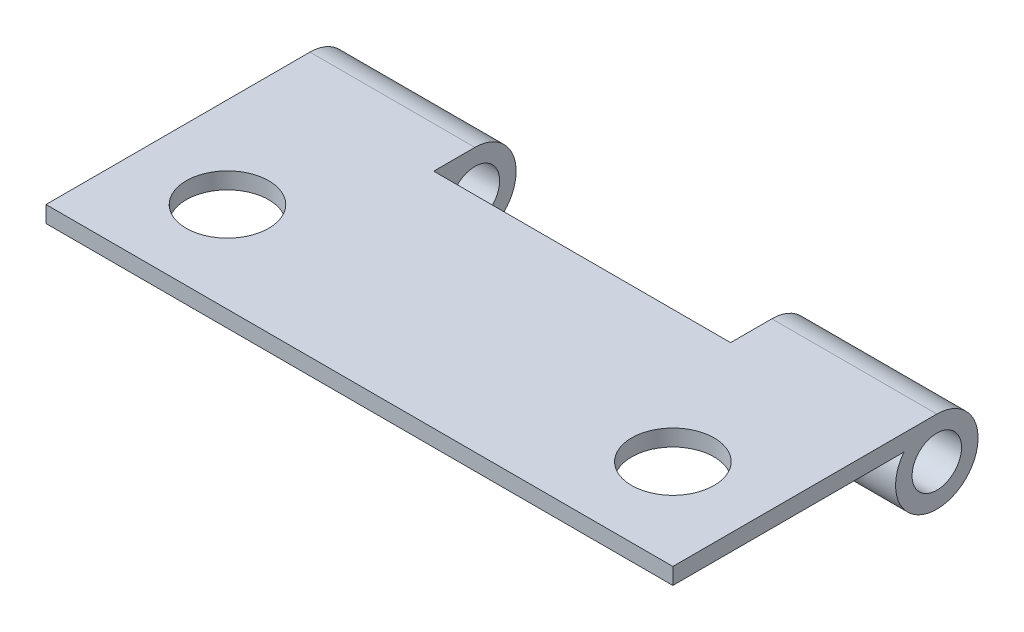
ISO-10303-21;
HEADER;
FILE_DESCRIPTION(('STEP AP214'),'2;1');
FILE_NAME('part.step','',(''),(''),'','','');
FILE_SCHEMA(('AUTOMOTIVE_DESIGN { 1 0 10303 214 1 1 1 1 }'));
ENDSEC;
DATA;
#1=APPLICATION_CONTEXT('core data for automotive mechanical design processes');
#2=APPLICATION_PROTOCOL_DEFINITION('international standard','automotive_design',2000,#1);
#3=PRODUCT_CONTEXT('',#1,'mechanical');
#4=PRODUCT('Part','Part','',(#3));
#5=PRODUCT_RELATED_PRODUCT_CATEGORY('part','',(#4));
#6=PRODUCT_DEFINITION_FORMATION('','',#4);
#7=PRODUCT_DEFINITION_CONTEXT('part definition',#1,'design');
#8=PRODUCT_DEFINITION('design','',#6,#7);
#9=PRODUCT_DEFINITION_SHAPE('','',#8);
#10=(LENGTH_UNIT() NAMED_UNIT(*) SI_UNIT(.MILLI.,.METRE.));
#11=(NAMED_UNIT(*) PLANE_ANGLE_UNIT() SI_UNIT($,.RADIAN.));
#12=(NAMED_UNIT(*) SI_UNIT($,.STERADIAN.) SOLID_ANGLE_UNIT());
#13=UNCERTAINTY_MEASURE_WITH_UNIT(LENGTH_MEASURE(1.E-05),#10,'distance_accuracy_value','');
#14=(GEOMETRIC_REPRESENTATION_CONTEXT(3) GLOBAL_UNCERTAINTY_ASSIGNED_CONTEXT((#13)) GLOBAL_UNIT_ASSIGNED_CONTEXT((#10,
#11,#12)) REPRESENTATION_CONTEXT('',''));
#15=CARTESIAN_POINT('',(0.,0.,0.));
#16=DIRECTION('',(0.,0.,1.));
#17=DIRECTION('',(1.,0.,0.));
#18=AXIS2_PLACEMENT_3D('',#15,#16,#17);
#19=CARTESIAN_POINT('',(38.,-1.50000000000001,-16.));
#20=DIRECTION('',(-1.,0.,0.));
#21=DIRECTION('',(0.,0.,1.));
#22=AXIS2_PLACEMENT_3D('',#19,#20,#21);
#23=CYLINDRICAL_SURFACE('',#22,2.50000000000001);
#24=DIRECTION('',(-1.,0.,0.));
#25=VECTOR('',#24,1.);
#26=CARTESIAN_POINT('',(38.,0.,-14.));
#27=LINE('',#26,#25);
#28=CARTESIAN_POINT('',(38.,0.,-14.));
#29=VERTEX_POINT('',#28);
#30=CARTESIAN_POINT('',(28.,0.,-14.));
#31=VERTEX_POINT('',#30);
#32=EDGE_CURVE('E43',#29,#31,#27,.T.);
#33=ORIENTED_EDGE('',*,*,#32,.T.);
#34=CARTESIAN_POINT('',(28.,-1.50000000000001,-16.));
#35=DIRECTION('',(1.,0.,0.));
#36=DIRECTION('',(0.,0.,-1.));
#37=AXIS2_PLACEMENT_3D('',#34,#35,#36);
#38=CIRCLE('',#37,2.50000000000001);
#39=CARTESIAN_POINT('',(28.,0.999999999999999,-16.));
#40=VERTEX_POINT('',#39);
#41=EDGE_CURVE('E134',#31,#40,#38,.T.);
#42=ORIENTED_EDGE('',*,*,#41,.T.);
#43=DIRECTION('',(-1.,0.,0.));
#44=VECTOR('',#43,1.);
#45=CARTESIAN_POINT('',(38.,0.999999999999998,-16.));
#46=LINE('',#45,#44);
#47=CARTESIAN_POINT('',(38.,0.999999999999998,-16.));
#48=VERTEX_POINT('',#47);
#49=EDGE_CURVE('E129',#48,#40,#46,.T.);
#50=ORIENTED_EDGE('',*,*,#49,.F.);
#51=CARTESIAN_POINT('',(38.,-1.50000000000001,-16.));
#52=DIRECTION('',(1.,0.,0.));
#53=DIRECTION('',(0.,0.,1.));
#54=AXIS2_PLACEMENT_3D('',#51,#52,#53);
#55=CIRCLE('',#54,2.50000000000001);
#56=EDGE_CURVE('E155',#29,#48,#55,.T.);
#57=ORIENTED_EDGE('',*,*,#56,.F.);
#58=EDGE_LOOP('',(#33,#42,#50,#57));
#59=FACE_BOUND('',#58,.T.);
#60=ADVANCED_FACE('F34',(#59),#23,.T.);
#61=CARTESIAN_POINT('',(38.,-1.5,-16.));
#62=DIRECTION('',(-1.,0.,0.));
#63=DIRECTION('',(0.,0.,1.));
#64=AXIS2_PLACEMENT_3D('',#61,#62,#63);
#65=CYLINDRICAL_SURFACE('',#64,1.5);
#66=CARTESIAN_POINT('',(10.,-1.5,-16.));
#67=DIRECTION('',(-1.,0.,0.));
#68=DIRECTION('',(0.,0.,1.));
#69=AXIS2_PLACEMENT_3D('',#66,#67,#68);
#70=CIRCLE('',#69,1.5);
#71=CARTESIAN_POINT('',(10.,-1.5,-14.5));
#72=VERTEX_POINT('',#71);
#73=EDGE_CURVE('E38',#72,#72,#70,.T.);
#74=ORIENTED_EDGE('',*,*,#73,.F.);
#75=EDGE_LOOP('',(#74));
#76=FACE_BOUND('',#75,.T.);
#77=CARTESIAN_POINT('',(0.,-1.5,-16.));
#78=DIRECTION('',(1.,0.,0.));
#79=DIRECTION('',(0.,0.,-1.));
#80=AXIS2_PLACEMENT_3D('',#77,#78,#79);
#81=CIRCLE('',#80,1.5);
#82=CARTESIAN_POINT('',(0.,-1.5,-17.5));
#83=VERTEX_POINT('',#82);
#84=EDGE_CURVE('E145',#83,#83,#81,.T.);
#85=ORIENTED_EDGE('',*,*,#84,.F.);
#86=EDGE_LOOP('',(#85));
#87=FACE_BOUND('',#86,.T.);
#88=ADVANCED_FACE('F181',(#76,#87),#65,.F.);
#89=CARTESIAN_POINT('',(38.,-1.50000000000001,-16.));
#90=DIRECTION('',(-1.,0.,0.));
#91=DIRECTION('',(0.,0.,1.));
#92=AXIS2_PLACEMENT_3D('',#89,#90,#91);
#93=PLANE('',#92);
#94=DIRECTION('',(0.,-1.,0.));
#95=VECTOR('',#94,1.);
#96=CARTESIAN_POINT('',(38.,0.,0.));
#97=LINE('',#96,#95);
#98=CARTESIAN_POINT('',(38.,1.,0.));
#99=VERTEX_POINT('',#98);
#100=CARTESIAN_POINT('',(38.,0.,0.));
#101=VERTEX_POINT('',#100);
#102=EDGE_CURVE('E152',#99,#101,#97,.T.);
#103=ORIENTED_EDGE('',*,*,#102,.T.);
#104=DIRECTION('',(0.,0.,-1.));
#105=VECTOR('',#104,1.);
#106=CARTESIAN_POINT('',(38.,0.,0.));
#107=LINE('',#106,#105);
#108=EDGE_CURVE('E87',#101,#29,#107,.T.);
#109=ORIENTED_EDGE('',*,*,#108,.T.);
#110=ORIENTED_EDGE('',*,*,#56,.T.);
#111=DIRECTION('',(0.,0.,1.));
#112=VECTOR('',#111,1.);
#113=CARTESIAN_POINT('',(38.,0.999999999999999,-16.));
#114=LINE('',#113,#112);
#115=EDGE_CURVE('E60',#48,#99,#114,.T.);
#116=ORIENTED_EDGE('',*,*,#115,.T.);
#117=EDGE_LOOP('',(#103,#109,#110,#116));
#118=FACE_BOUND('',#117,.T.);
#119=CARTESIAN_POINT('',(38.,-1.5,-16.));
#120=DIRECTION('',(1.,0.,0.));
#121=DIRECTION('',(0.,0.,-1.));
#122=AXIS2_PLACEMENT_3D('',#119,#120,#121);
#123=CIRCLE('',#122,1.5);
#124=CARTESIAN_POINT('',(38.,-1.5,-17.5));
#125=VERTEX_POINT('',#124);
#126=EDGE_CURVE('E146',#125,#125,#123,.T.);
#127=ORIENTED_EDGE('',*,*,#126,.F.);
#128=EDGE_LOOP('',(#127));
#129=FACE_BOUND('',#128,.T.);
#130=ADVANCED_FACE('F184',(#118,#129),#93,.F.);
#131=CARTESIAN_POINT('',(0.,-1.50000000000001,-16.));
#132=DIRECTION('',(-1.,0.,0.));
#133=DIRECTION('',(0.,0.,1.));
#134=AXIS2_PLACEMENT_3D('',#131,#132,#133);
#135=PLANE('',#134);
#136=DIRECTION('',(0.,-1.,0.));
#137=VECTOR('',#136,1.);
#138=CARTESIAN_POINT('',(0.,0.,0.));
#139=LINE('',#138,#137);
#140=CARTESIAN_POINT('',(0.,1.,0.));
#141=VERTEX_POINT('',#140);
#142=CARTESIAN_POINT('',(0.,0.,0.));
#143=VERTEX_POINT('',#142);
#144=EDGE_CURVE('E149',#141,#143,#139,.T.);
#145=ORIENTED_EDGE('',*,*,#144,.F.);
#146=DIRECTION('',(0.,0.,1.));
#147=VECTOR('',#146,1.);
#148=CARTESIAN_POINT('',(0.,0.999999999999999,-16.));
#149=LINE('',#148,#147);
#150=CARTESIAN_POINT('',(0.,0.999999999999998,-16.));
#151=VERTEX_POINT('',#150);
#152=EDGE_CURVE('E80',#151,#141,#149,.T.);
#153=ORIENTED_EDGE('',*,*,#152,.F.);
#154=CARTESIAN_POINT('',(0.,-1.50000000000001,-16.));
#155=DIRECTION('',(1.,0.,0.));
#156=DIRECTION('',(0.,0.,1.));
#157=AXIS2_PLACEMENT_3D('',#154,#155,#156);
#158=CIRCLE('',#157,2.50000000000001);
#159=CARTESIAN_POINT('',(0.,0.,-14.));
#160=VERTEX_POINT('',#159);
#161=EDGE_CURVE('E164',#160,#151,#158,.T.);
#162=ORIENTED_EDGE('',*,*,#161,.F.);
#163=DIRECTION('',(0.,0.,-1.));
#164=VECTOR('',#163,1.);
#165=CARTESIAN_POINT('',(0.,0.,0.));
#166=LINE('',#165,#164);
#167=EDGE_CURVE('E161',#143,#160,#166,.T.);
#168=ORIENTED_EDGE('',*,*,#167,.F.);
#169=EDGE_LOOP('',(#145,#153,#162,#168));
#170=FACE_BOUND('',#169,.T.);
#171=ORIENTED_EDGE('',*,*,#84,.T.);
#172=EDGE_LOOP('',(#171));
#173=FACE_BOUND('',#172,.T.);
#174=ADVANCED_FACE('F186',(#170,#173),#135,.T.);
#175=CARTESIAN_POINT('',(38.,0.,0.));
#176=DIRECTION('',(0.,0.,-1.));
#177=DIRECTION('',(-1.,0.,0.));
#178=AXIS2_PLACEMENT_3D('',#175,#176,#177);
#179=PLANE('',#178);
#180=ORIENTED_EDGE('',*,*,#144,.T.);
#181=DIRECTION('',(-1.,0.,0.));
#182=VECTOR('',#181,1.);
#183=CARTESIAN_POINT('',(38.,0.,0.));
#184=LINE('',#183,#182);
#185=EDGE_CURVE('E11',#101,#143,#184,.T.);
#186=ORIENTED_EDGE('',*,*,#185,.F.);
#187=ORIENTED_EDGE('',*,*,#102,.F.);
#188=DIRECTION('',(-1.,0.,0.));
#189=VECTOR('',#188,1.);
#190=CARTESIAN_POINT('',(38.,1.,0.));
#191=LINE('',#190,#189);
#192=EDGE_CURVE('E158',#99,#141,#191,.T.);
#193=ORIENTED_EDGE('',*,*,#192,.T.);
#194=EDGE_LOOP('',(#180,#186,#187,#193));
#195=FACE_BOUND('',#194,.T.);
#196=ADVANCED_FACE('F36',(#195),#179,.F.);
#197=CARTESIAN_POINT('',(38.,0.,0.));
#198=DIRECTION('',(0.,1.,0.));
#199=DIRECTION('',(0.,0.,1.));
#200=AXIS2_PLACEMENT_3D('',#197,#198,#199);
#201=PLANE('',#200);
#202=CARTESIAN_POINT('',(32.5,0.,-5.5));
#203=DIRECTION('',(0.,1.,0.));
#204=DIRECTION('',(0.,0.,1.));
#205=AXIS2_PLACEMENT_3D('',#202,#203,#204);
#206=CIRCLE('',#205,2.5);
#207=CARTESIAN_POINT('',(32.5,0.,-3.));
#208=VERTEX_POINT('',#207);
#209=EDGE_CURVE('E222',#208,#208,#206,.T.);
#210=ORIENTED_EDGE('',*,*,#209,.T.);
#211=EDGE_LOOP('',(#210));
#212=FACE_BOUND('',#211,.T.);
#213=CARTESIAN_POINT('',(5.5,0.,-5.5));
#214=DIRECTION('',(0.,1.,0.));
#215=DIRECTION('',(0.,0.,1.));
#216=AXIS2_PLACEMENT_3D('',#213,#214,#215);
#217=CIRCLE('',#216,2.5);
#218=CARTESIAN_POINT('',(5.5,0.,-3.));
#219=VERTEX_POINT('',#218);
#220=EDGE_CURVE('E215',#219,#219,#217,.T.);
#221=ORIENTED_EDGE('',*,*,#220,.T.);
#222=EDGE_LOOP('',(#221));
#223=FACE_BOUND('',#222,.T.);
#224=CARTESIAN_POINT('',(10.,0.,-14.));
#225=VERTEX_POINT('',#224);
#226=EDGE_CURVE('E171',#225,#160,#27,.T.);
#227=ORIENTED_EDGE('',*,*,#226,.F.);
#228=DIRECTION('',(0.,0.,1.));
#229=VECTOR('',#228,1.);
#230=CARTESIAN_POINT('',(10.,0.,0.));
#231=LINE('',#230,#229);
#232=CARTESIAN_POINT('',(10.,0.,-13.5));
#233=VERTEX_POINT('',#232);
#234=EDGE_CURVE('E140',#225,#233,#231,.T.);
#235=ORIENTED_EDGE('',*,*,#234,.T.);
#236=DIRECTION('',(1.,0.,0.));
#237=VECTOR('',#236,1.);
#238=CARTESIAN_POINT('',(38.,0.,-13.5));
#239=LINE('',#238,#237);
#240=CARTESIAN_POINT('',(28.,0.,-13.5));
#241=VERTEX_POINT('',#240);
#242=EDGE_CURVE('E143',#233,#241,#239,.T.);
#243=ORIENTED_EDGE('',*,*,#242,.T.);
#244=DIRECTION('',(0.,0.,-1.));
#245=VECTOR('',#244,1.);
#246=CARTESIAN_POINT('',(28.,0.,0.));
#247=LINE('',#246,#245);
#248=EDGE_CURVE('E117',#241,#31,#247,.T.);
#249=ORIENTED_EDGE('',*,*,#248,.T.);
#250=ORIENTED_EDGE('',*,*,#32,.F.);
#251=ORIENTED_EDGE('',*,*,#108,.F.);
#252=ORIENTED_EDGE('',*,*,#185,.T.);
#253=ORIENTED_EDGE('',*,*,#167,.T.);
#254=EDGE_LOOP('',(#227,#235,#243,#249,#250,#251,#252,#253));
#255=FACE_BOUND('',#254,.T.);
#256=ADVANCED_FACE('F204',(#212,#223,#255),#201,.F.);
#257=CARTESIAN_POINT('',(10.,0.999999999999999,-16.));
#258=VERTEX_POINT('',#257);
#259=EDGE_CURVE('E169',#258,#151,#46,.T.);
#260=ORIENTED_EDGE('',*,*,#259,.F.);
#261=CARTESIAN_POINT('',(10.,-1.50000000000001,-16.));
#262=DIRECTION('',(-1.,0.,0.));
#263=DIRECTION('',(0.,0.,1.));
#264=AXIS2_PLACEMENT_3D('',#261,#262,#263);
#265=CIRCLE('',#264,2.50000000000001);
#266=EDGE_CURVE('E137',#258,#225,#265,.T.);
#267=ORIENTED_EDGE('',*,*,#266,.T.);
#268=ORIENTED_EDGE('',*,*,#226,.T.);
#269=ORIENTED_EDGE('',*,*,#161,.T.);
#270=EDGE_LOOP('',(#260,#267,#268,#269));
#271=FACE_BOUND('',#270,.T.);
#272=ADVANCED_FACE('F198',(#271),#23,.T.);
#273=CARTESIAN_POINT('',(38.,0.999999999999999,-16.));
#274=DIRECTION('',(0.,-1.,0.));
#275=DIRECTION('',(0.,0.,-1.));
#276=AXIS2_PLACEMENT_3D('',#273,#274,#275);
#277=PLANE('',#276);
#278=CARTESIAN_POINT('',(32.5,1.,-5.5));
#279=DIRECTION('',(0.,1.,0.));
#280=DIRECTION('',(0.,0.,-1.));
#281=AXIS2_PLACEMENT_3D('',#278,#279,#280);
#282=CIRCLE('',#281,2.5);
#283=CARTESIAN_POINT('',(32.5,0.999999999999999,-8.));
#284=VERTEX_POINT('',#283);
#285=EDGE_CURVE('E225',#284,#284,#282,.T.);
#286=ORIENTED_EDGE('',*,*,#285,.F.);
#287=EDGE_LOOP('',(#286));
#288=FACE_BOUND('',#287,.T.);
#289=CARTESIAN_POINT('',(5.5,1.,-5.5));
#290=DIRECTION('',(0.,1.,0.));
#291=DIRECTION('',(0.,0.,1.));
#292=AXIS2_PLACEMENT_3D('',#289,#290,#291);
#293=CIRCLE('',#292,2.5);
#294=CARTESIAN_POINT('',(5.5,1.,-3.));
#295=VERTEX_POINT('',#294);
#296=EDGE_CURVE('E217',#295,#295,#293,.T.);
#297=ORIENTED_EDGE('',*,*,#296,.F.);
#298=EDGE_LOOP('',(#297));
#299=FACE_BOUND('',#298,.T.);
#300=DIRECTION('',(1.,0.,0.));
#301=VECTOR('',#300,1.);
#302=CARTESIAN_POINT('',(10.,0.999999999999999,-13.5));
#303=LINE('',#302,#301);
#304=CARTESIAN_POINT('',(10.,0.999999999999999,-13.5));
#305=VERTEX_POINT('',#304);
#306=CARTESIAN_POINT('',(28.,0.999999999999999,-13.5));
#307=VERTEX_POINT('',#306);
#308=EDGE_CURVE('E124',#305,#307,#303,.T.);
#309=ORIENTED_EDGE('',*,*,#308,.F.);
#310=DIRECTION('',(0.,0.,1.));
#311=VECTOR('',#310,1.);
#312=CARTESIAN_POINT('',(10.,0.999999999999999,-13.5));
#313=LINE('',#312,#311);
#314=EDGE_CURVE('E51',#258,#305,#313,.T.);
#315=ORIENTED_EDGE('',*,*,#314,.F.);
#316=ORIENTED_EDGE('',*,*,#259,.T.);
#317=ORIENTED_EDGE('',*,*,#152,.T.);
#318=ORIENTED_EDGE('',*,*,#192,.F.);
#319=ORIENTED_EDGE('',*,*,#115,.F.);
#320=ORIENTED_EDGE('',*,*,#49,.T.);
#321=DIRECTION('',(0.,0.,-1.));
#322=VECTOR('',#321,1.);
#323=CARTESIAN_POINT('',(28.,0.999999999999999,-13.5));
#324=LINE('',#323,#322);
#325=EDGE_CURVE('E114',#307,#40,#324,.T.);
#326=ORIENTED_EDGE('',*,*,#325,.F.);
#327=EDGE_LOOP('',(#309,#315,#316,#317,#318,#319,#320,#326));
#328=FACE_BOUND('',#327,.T.);
#329=ADVANCED_FACE('F127',(#288,#299,#328),#277,.F.);
#330=CARTESIAN_POINT('',(28.,-1.5,-16.));
#331=DIRECTION('',(1.,0.,0.));
#332=DIRECTION('',(0.,0.,-1.));
#333=AXIS2_PLACEMENT_3D('',#330,#331,#332);
#334=CIRCLE('',#333,1.5);
#335=CARTESIAN_POINT('',(28.,-1.5,-17.5));
#336=VERTEX_POINT('',#335);
#337=EDGE_CURVE('E120',#336,#336,#334,.T.);
#338=ORIENTED_EDGE('',*,*,#337,.F.);
#339=EDGE_LOOP('',(#338));
#340=FACE_BOUND('',#339,.T.);
#341=ORIENTED_EDGE('',*,*,#126,.T.);
#342=EDGE_LOOP('',(#341));
#343=FACE_BOUND('',#342,.T.);
#344=ADVANCED_FACE('F177',(#340,#343),#65,.F.);
#345=CARTESIAN_POINT('',(10.,-4.00000000000002,-13.5));
#346=DIRECTION('',(0.,0.,1.));
#347=DIRECTION('',(0.,-1.,0.));
#348=AXIS2_PLACEMENT_3D('',#345,#346,#347);
#349=PLANE('',#348);
#350=DIRECTION('',(0.,1.,0.));
#351=VECTOR('',#350,1.);
#352=CARTESIAN_POINT('',(10.,-4.00000000000002,-13.5));
#353=LINE('',#352,#351);
#354=EDGE_CURVE('E121',#233,#305,#353,.T.);
#355=ORIENTED_EDGE('',*,*,#354,.T.);
#356=ORIENTED_EDGE('',*,*,#308,.T.);
#357=DIRECTION('',(0.,1.,0.));
#358=VECTOR('',#357,1.);
#359=CARTESIAN_POINT('',(28.,-4.00000000000002,-13.5));
#360=LINE('',#359,#358);
#361=EDGE_CURVE('E110',#241,#307,#360,.T.);
#362=ORIENTED_EDGE('',*,*,#361,.F.);
#363=ORIENTED_EDGE('',*,*,#242,.F.);
#364=EDGE_LOOP('',(#355,#356,#362,#363));
#365=FACE_BOUND('',#364,.T.);
#366=ADVANCED_FACE('F125',(#365),#349,.F.);
#367=CARTESIAN_POINT('',(10.,-4.00000000000002,-13.5));
#368=DIRECTION('',(-1.,0.,0.));
#369=DIRECTION('',(0.,0.,1.));
#370=AXIS2_PLACEMENT_3D('',#367,#368,#369);
#371=PLANE('',#370);
#372=ORIENTED_EDGE('',*,*,#73,.T.);
#373=EDGE_LOOP('',(#372));
#374=FACE_BOUND('',#373,.T.);
#375=ORIENTED_EDGE('',*,*,#266,.F.);
#376=ORIENTED_EDGE('',*,*,#314,.T.);
#377=ORIENTED_EDGE('',*,*,#354,.F.);
#378=ORIENTED_EDGE('',*,*,#234,.F.);
#379=EDGE_LOOP('',(#375,#376,#377,#378));
#380=FACE_BOUND('',#379,.T.);
#381=ADVANCED_FACE('F246',(#374,#380),#371,.F.);
#382=CARTESIAN_POINT('',(28.,-4.00000000000002,-13.5));
#383=DIRECTION('',(1.,0.,0.));
#384=DIRECTION('',(0.,0.,-1.));
#385=AXIS2_PLACEMENT_3D('',#382,#383,#384);
#386=PLANE('',#385);
#387=ORIENTED_EDGE('',*,*,#337,.T.);
#388=EDGE_LOOP('',(#387));
#389=FACE_BOUND('',#388,.T.);
#390=ORIENTED_EDGE('',*,*,#361,.T.);
#391=ORIENTED_EDGE('',*,*,#325,.T.);
#392=ORIENTED_EDGE('',*,*,#41,.F.);
#393=ORIENTED_EDGE('',*,*,#248,.F.);
#394=EDGE_LOOP('',(#390,#391,#392,#393));
#395=FACE_BOUND('',#394,.T.);
#396=ADVANCED_FACE('F112',(#389,#395),#386,.F.);
#397=CARTESIAN_POINT('',(5.5,-9.,-5.5));
#398=DIRECTION('',(0.,1.,0.));
#399=DIRECTION('',(0.,0.,1.));
#400=AXIS2_PLACEMENT_3D('',#397,#398,#399);
#401=CYLINDRICAL_SURFACE('',#400,2.5);
#402=ORIENTED_EDGE('',*,*,#296,.T.);
#403=EDGE_LOOP('',(#402));
#404=FACE_BOUND('',#403,.T.);
#405=ORIENTED_EDGE('',*,*,#220,.F.);
#406=EDGE_LOOP('',(#405));
#407=FACE_BOUND('',#406,.T.);
#408=ADVANCED_FACE('F234',(#404,#407),#401,.F.);
#409=CARTESIAN_POINT('',(32.5,-9.,-5.5));
#410=DIRECTION('',(0.,1.,0.));
#411=DIRECTION('',(0.,0.,1.));
#412=AXIS2_PLACEMENT_3D('',#409,#410,#411);
#413=CYLINDRICAL_SURFACE('',#412,2.5);
#414=ORIENTED_EDGE('',*,*,#285,.T.);
#415=EDGE_LOOP('',(#414));
#416=FACE_BOUND('',#415,.T.);
#417=ORIENTED_EDGE('',*,*,#209,.F.);
#418=EDGE_LOOP('',(#417));
#419=FACE_BOUND('',#418,.T.);
#420=ADVANCED_FACE('F229',(#416,#419),#413,.F.);
#421=CLOSED_SHELL('',(#60,#88,#130,#174,#196,#256,#272,#329,#344,#366,#381,#396,#408,#420));
#422=MANIFOLD_SOLID_BREP('B2',#421);
#423=ADVANCED_BREP_SHAPE_REPRESENTATION('',(#18,#422),#14);
#424=SHAPE_DEFINITION_REPRESENTATION(#9,#423);
ENDSEC;
END-ISO-10303-21;
